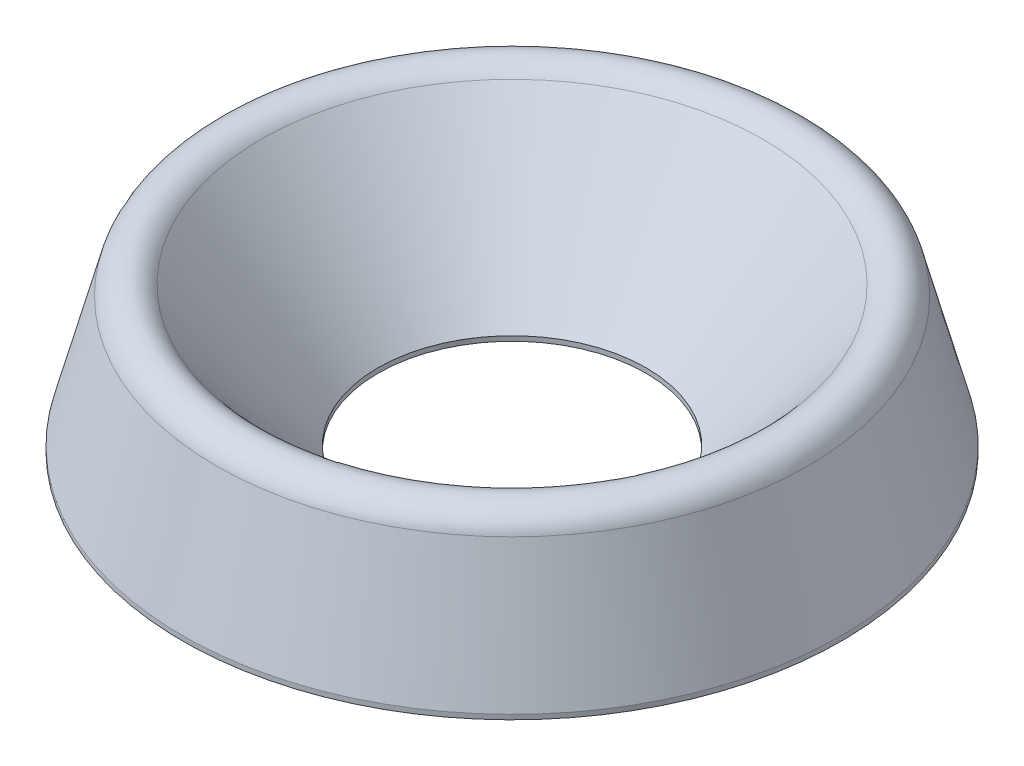
ISO-10303-21;
HEADER;
FILE_DESCRIPTION(('STEP AP214'),'2;1');
FILE_NAME('part.step','',(''),(''),'','','');
FILE_SCHEMA(('AUTOMOTIVE_DESIGN { 1 0 10303 214 1 1 1 1 }'));
ENDSEC;
DATA;
#1=APPLICATION_CONTEXT('core data for automotive mechanical design processes');
#2=APPLICATION_PROTOCOL_DEFINITION('international standard','automotive_design',2000,#1);
#3=PRODUCT_CONTEXT('',#1,'mechanical');
#4=PRODUCT('Part','Part','',(#3));
#5=PRODUCT_RELATED_PRODUCT_CATEGORY('part','',(#4));
#6=PRODUCT_DEFINITION_FORMATION('','',#4);
#7=PRODUCT_DEFINITION_CONTEXT('part definition',#1,'design');
#8=PRODUCT_DEFINITION('design','',#6,#7);
#9=PRODUCT_DEFINITION_SHAPE('','',#8);
#10=(LENGTH_UNIT() NAMED_UNIT(*) SI_UNIT(.MILLI.,.METRE.));
#11=(NAMED_UNIT(*) PLANE_ANGLE_UNIT() SI_UNIT($,.RADIAN.));
#12=(NAMED_UNIT(*) SI_UNIT($,.STERADIAN.) SOLID_ANGLE_UNIT());
#13=UNCERTAINTY_MEASURE_WITH_UNIT(LENGTH_MEASURE(1.E-05),#10,'distance_accuracy_value','');
#14=(GEOMETRIC_REPRESENTATION_CONTEXT(3) GLOBAL_UNCERTAINTY_ASSIGNED_CONTEXT((#13)) GLOBAL_UNIT_ASSIGNED_CONTEXT((#10,
#11,#12)) REPRESENTATION_CONTEXT('',''));
#15=CARTESIAN_POINT('',(0.,0.,0.));
#16=DIRECTION('',(0.,0.,1.));
#17=DIRECTION('',(1.,0.,0.));
#18=AXIS2_PLACEMENT_3D('',#15,#16,#17);
#19=CARTESIAN_POINT('',(-3.556,0.,0.));
#20=DIRECTION('',(0.,1.,0.));
#21=DIRECTION('',(0.,0.,1.));
#22=AXIS2_PLACEMENT_3D('',#19,#20,#21);
#23=PLANE('',#22);
#24=CARTESIAN_POINT('',(0.,0.,0.));
#25=DIRECTION('',(0.,-1.,0.));
#26=DIRECTION('',(0.,0.,-1.));
#27=AXIS2_PLACEMENT_3D('',#24,#25,#26);
#28=CIRCLE('',#27,8.7376);
#29=CARTESIAN_POINT('',(0.,0.,-8.7376));
#30=VERTEX_POINT('',#29);
#31=EDGE_CURVE('E44',#30,#30,#28,.T.);
#32=ORIENTED_EDGE('',*,*,#31,.T.);
#33=EDGE_LOOP('',(#32));
#34=FACE_BOUND('',#33,.T.);
#35=CARTESIAN_POINT('',(0.,0.,0.));
#36=DIRECTION('',(0.,1.,0.));
#37=DIRECTION('',(0.,0.,1.));
#38=AXIS2_PLACEMENT_3D('',#35,#36,#37);
#39=CIRCLE('',#38,7.94385);
#40=CARTESIAN_POINT('',(0.,0.,7.94385));
#41=VERTEX_POINT('',#40);
#42=EDGE_CURVE('E59',#41,#41,#39,.F.);
#43=ORIENTED_EDGE('',*,*,#42,.F.);
#44=EDGE_LOOP('',(#43));
#45=FACE_BOUND('',#44,.T.);
#46=ADVANCED_FACE('F29',(#34,#45),#23,.F.);
#47=CARTESIAN_POINT('',(0.,3.38666666666667,0.));
#48=DIRECTION('',(0.,-1.,0.));
#49=DIRECTION('',(0.,0.,-1.));
#50=AXIS2_PLACEMENT_3D('',#47,#48,#49);
#51=TOROIDAL_SURFACE('',#50,7.17538096840195,0.677333333333334);
#52=CARTESIAN_POINT('',(0.,3.55976025344423,0.));
#53=DIRECTION('',(0.,-1.,0.));
#54=DIRECTION('',(0.,0.,-1.));
#55=AXIS2_PLACEMENT_3D('',#52,#53,#54);
#56=CIRCLE('',#55,7.83022373934848);
#57=CARTESIAN_POINT('',(0.,3.55976025344423,-7.83022373934848));
#58=VERTEX_POINT('',#57);
#59=EDGE_CURVE('E52',#58,#58,#56,.T.);
#60=ORIENTED_EDGE('',*,*,#59,.F.);
#61=EDGE_LOOP('',(#60));
#62=FACE_BOUND('',#61,.T.);
#63=CARTESIAN_POINT('',(0.,3.82204814096102,0.));
#64=DIRECTION('',(0.,-1.,0.));
#65=DIRECTION('',(0.,0.,-1.));
#66=AXIS2_PLACEMENT_3D('',#63,#64,#65);
#67=CIRCLE('',#66,6.6565135322627);
#68=CARTESIAN_POINT('',(0.,3.82204814096102,-6.6565135322627));
#69=VERTEX_POINT('',#68);
#70=EDGE_CURVE('E10',#69,#69,#67,.T.);
#71=ORIENTED_EDGE('',*,*,#70,.T.);
#72=EDGE_LOOP('',(#71));
#73=FACE_BOUND('',#72,.T.);
#74=ADVANCED_FACE('F31',(#62,#73),#51,.T.);
#75=CARTESIAN_POINT('',(0.,0.127,0.));
#76=DIRECTION('',(0.,1.,0.));
#77=DIRECTION('',(0.,0.,1.));
#78=AXIS2_PLACEMENT_3D('',#75,#76,#77);
#79=CONICAL_SURFACE('',#78,3.556,0.698131700797734);
#80=ORIENTED_EDGE('',*,*,#70,.F.);
#81=EDGE_LOOP('',(#80));
#82=FACE_BOUND('',#81,.T.);
#83=CARTESIAN_POINT('',(0.,0.127,0.));
#84=DIRECTION('',(0.,-1.,0.));
#85=DIRECTION('',(0.,0.,-1.));
#86=AXIS2_PLACEMENT_3D('',#83,#84,#85);
#87=CIRCLE('',#86,3.556);
#88=CARTESIAN_POINT('',(0.,0.127,-3.556));
#89=VERTEX_POINT('',#88);
#90=EDGE_CURVE('E36',#89,#89,#87,.T.);
#91=ORIENTED_EDGE('',*,*,#90,.T.);
#92=EDGE_LOOP('',(#91));
#93=FACE_BOUND('',#92,.T.);
#94=ADVANCED_FACE('F89',(#82,#93),#79,.F.);
#95=CARTESIAN_POINT('',(0.,0.,0.));
#96=DIRECTION('',(0.,-1.,0.));
#97=DIRECTION('',(0.,0.,-1.));
#98=AXIS2_PLACEMENT_3D('',#95,#96,#97);
#99=CYLINDRICAL_SURFACE('',#98,3.556);
#100=ORIENTED_EDGE('',*,*,#90,.F.);
#101=EDGE_LOOP('',(#100));
#102=FACE_BOUND('',#101,.T.);
#103=CARTESIAN_POINT('',(0.,0.,0.));
#104=DIRECTION('',(0.,-1.,0.));
#105=DIRECTION('',(0.,0.,-1.));
#106=AXIS2_PLACEMENT_3D('',#103,#104,#105);
#107=CIRCLE('',#106,3.556);
#108=CARTESIAN_POINT('',(0.,0.,-3.556));
#109=VERTEX_POINT('',#108);
#110=EDGE_CURVE('E40',#109,#109,#107,.T.);
#111=ORIENTED_EDGE('',*,*,#110,.T.);
#112=EDGE_LOOP('',(#111));
#113=FACE_BOUND('',#112,.T.);
#114=ADVANCED_FACE('F96',(#102,#113),#99,.F.);
#115=CARTESIAN_POINT('',(0.,0.,0.));
#116=DIRECTION('',(0.,1.,0.));
#117=DIRECTION('',(0.,0.,1.));
#118=AXIS2_PLACEMENT_3D('',#115,#116,#117);
#119=CIRCLE('',#118,4.48560138274798);
#120=CARTESIAN_POINT('',(0.,0.,4.48560138274798));
#121=VERTEX_POINT('',#120);
#122=EDGE_CURVE('E55',#121,#121,#119,.F.);
#123=ORIENTED_EDGE('',*,*,#122,.T.);
#124=EDGE_LOOP('',(#123));
#125=FACE_BOUND('',#124,.T.);
#126=ORIENTED_EDGE('',*,*,#110,.F.);
#127=EDGE_LOOP('',(#126));
#128=FACE_BOUND('',#127,.T.);
#129=ADVANCED_FACE('F85',(#125,#128),#23,.F.);
#130=CARTESIAN_POINT('',(0.,0.,0.));
#131=DIRECTION('',(0.,-1.,0.));
#132=DIRECTION('',(0.,0.,-1.));
#133=AXIS2_PLACEMENT_3D('',#130,#131,#132);
#134=CYLINDRICAL_SURFACE('',#133,8.7376);
#135=ORIENTED_EDGE('',*,*,#31,.F.);
#136=EDGE_LOOP('',(#135));
#137=FACE_BOUND('',#136,.T.);
#138=CARTESIAN_POINT('',(0.,0.127,0.));
#139=DIRECTION('',(0.,-1.,0.));
#140=DIRECTION('',(0.,0.,-1.));
#141=AXIS2_PLACEMENT_3D('',#138,#139,#140);
#142=CIRCLE('',#141,8.7376);
#143=CARTESIAN_POINT('',(0.,0.127,-8.7376));
#144=VERTEX_POINT('',#143);
#145=EDGE_CURVE('E49',#144,#144,#142,.T.);
#146=ORIENTED_EDGE('',*,*,#145,.T.);
#147=EDGE_LOOP('',(#146));
#148=FACE_BOUND('',#147,.T.);
#149=ADVANCED_FACE('F95',(#137,#148),#134,.T.);
#150=CARTESIAN_POINT('',(0.,3.55976025344423,0.));
#151=DIRECTION('',(0.,-1.,0.));
#152=DIRECTION('',(0.,0.,-1.));
#153=AXIS2_PLACEMENT_3D('',#150,#151,#152);
#154=CONICAL_SURFACE('',#153,7.83022373934848,0.258418158666611);
#155=ORIENTED_EDGE('',*,*,#145,.F.);
#156=EDGE_LOOP('',(#155));
#157=FACE_BOUND('',#156,.T.);
#158=ORIENTED_EDGE('',*,*,#59,.T.);
#159=EDGE_LOOP('',(#158));
#160=FACE_BOUND('',#159,.T.);
#161=ADVANCED_FACE('F102',(#157,#160),#154,.T.);
#162=CARTESIAN_POINT('',(0.,-0.383212665188692,0.));
#163=DIRECTION('',(0.,1.,0.));
#164=DIRECTION('',(0.,0.,1.));
#165=AXIS2_PLACEMENT_3D('',#162,#163,#164);
#166=CONICAL_SURFACE('',#165,4.16404777672569,0.698131700797734);
#167=CARTESIAN_POINT('',(0.,3.1398121954208,0.));
#168=DIRECTION('',(0.,1.,0.));
#169=DIRECTION('',(0.,0.,1.));
#170=AXIS2_PLACEMENT_3D('',#167,#168,#169);
#171=CIRCLE('',#170,7.12021663789152);
#172=CARTESIAN_POINT('',(0.,3.1398121954208,7.12021663789152));
#173=VERTEX_POINT('',#172);
#174=EDGE_CURVE('E58',#173,#173,#171,.F.);
#175=ORIENTED_EDGE('',*,*,#174,.T.);
#176=EDGE_LOOP('',(#175));
#177=FACE_BOUND('',#176,.T.);
#178=ORIENTED_EDGE('',*,*,#122,.F.);
#179=EDGE_LOOP('',(#178));
#180=FACE_BOUND('',#179,.T.);
#181=ADVANCED_FACE('F68',(#177,#180),#166,.T.);
#182=CARTESIAN_POINT('',(0.,0.,0.));
#183=DIRECTION('',(0.,-1.,0.));
#184=DIRECTION('',(0.,0.,-1.));
#185=AXIS2_PLACEMENT_3D('',#182,#183,#184);
#186=CYLINDRICAL_SURFACE('',#185,7.94385);
#187=ORIENTED_EDGE('',*,*,#42,.T.);
#188=EDGE_LOOP('',(#187));
#189=FACE_BOUND('',#188,.T.);
#190=CARTESIAN_POINT('',(0.,0.0238657116252861,0.));
#191=DIRECTION('',(0.,-1.,0.));
#192=DIRECTION('',(0.,0.,-1.));
#193=AXIS2_PLACEMENT_3D('',#190,#191,#192);
#194=CIRCLE('',#193,7.94385);
#195=CARTESIAN_POINT('',(0.,0.0238657116252861,-7.94385));
#196=VERTEX_POINT('',#195);
#197=EDGE_CURVE('E62',#196,#196,#194,.T.);
#198=ORIENTED_EDGE('',*,*,#197,.F.);
#199=EDGE_LOOP('',(#198));
#200=FACE_BOUND('',#199,.T.);
#201=ADVANCED_FACE('F73',(#189,#200),#186,.F.);
#202=CARTESIAN_POINT('',(0.,3.35691620643927,0.));
#203=DIRECTION('',(0.,-1.,0.));
#204=DIRECTION('',(0.,0.,-1.));
#205=AXIS2_PLACEMENT_3D('',#202,#203,#204);
#206=CONICAL_SURFACE('',#205,7.06282986714552,0.258418158666611);
#207=ORIENTED_EDGE('',*,*,#197,.T.);
#208=EDGE_LOOP('',(#207));
#209=FACE_BOUND('',#208,.T.);
#210=ORIENTED_EDGE('',*,*,#174,.F.);
#211=EDGE_LOOP('',(#210));
#212=FACE_BOUND('',#211,.T.);
#213=ADVANCED_FACE('F71',(#209,#212),#206,.F.);
#214=CLOSED_SHELL('',(#46,#74,#94,#114,#129,#149,#161,#181,#201,#213));
#215=MANIFOLD_SOLID_BREP('B2',#214);
#216=ADVANCED_BREP_SHAPE_REPRESENTATION('',(#18,#215),#14);
#217=SHAPE_DEFINITION_REPRESENTATION(#9,#216);
ENDSEC;
END-ISO-10303-21;
